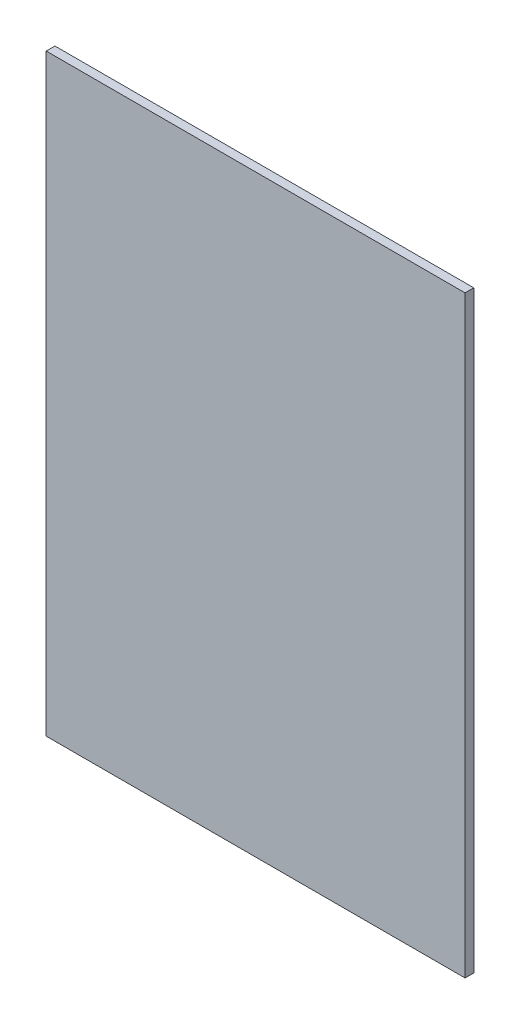
ISO-10303-21;
HEADER;
FILE_DESCRIPTION(('STEP AP214'),'2;1');
FILE_NAME('part.step','',(''),(''),'','','');
FILE_SCHEMA(('AUTOMOTIVE_DESIGN { 1 0 10303 214 1 1 1 1 }'));
ENDSEC;
DATA;
#1=APPLICATION_CONTEXT('core data for automotive mechanical design processes');
#2=APPLICATION_PROTOCOL_DEFINITION('international standard','automotive_design',2000,#1);
#3=PRODUCT_CONTEXT('',#1,'mechanical');
#4=PRODUCT('Part','Part','',(#3));
#5=PRODUCT_RELATED_PRODUCT_CATEGORY('part','',(#4));
#6=PRODUCT_DEFINITION_FORMATION('','',#4);
#7=PRODUCT_DEFINITION_CONTEXT('part definition',#1,'design');
#8=PRODUCT_DEFINITION('design','',#6,#7);
#9=PRODUCT_DEFINITION_SHAPE('','',#8);
#10=(LENGTH_UNIT() NAMED_UNIT(*) SI_UNIT(.MILLI.,.METRE.));
#11=(NAMED_UNIT(*) PLANE_ANGLE_UNIT() SI_UNIT($,.RADIAN.));
#12=(NAMED_UNIT(*) SI_UNIT($,.STERADIAN.) SOLID_ANGLE_UNIT());
#13=UNCERTAINTY_MEASURE_WITH_UNIT(LENGTH_MEASURE(1.E-05),#10,'distance_accuracy_value','');
#14=(GEOMETRIC_REPRESENTATION_CONTEXT(3) GLOBAL_UNCERTAINTY_ASSIGNED_CONTEXT((#13)) GLOBAL_UNIT_ASSIGNED_CONTEXT((#10,
#11,#12)) REPRESENTATION_CONTEXT('',''));
#15=CARTESIAN_POINT('',(0.,0.,0.));
#16=DIRECTION('',(0.,0.,1.));
#17=DIRECTION('',(1.,0.,0.));
#18=AXIS2_PLACEMENT_3D('',#15,#16,#17);
#19=CARTESIAN_POINT('',(-290.,340.,10.));
#20=DIRECTION('',(1.,0.,0.));
#21=DIRECTION('',(0.,1.,0.));
#22=AXIS2_PLACEMENT_3D('',#19,#20,#21);
#23=PLANE('',#22);
#24=DIRECTION('',(0.,-1.,0.));
#25=VECTOR('',#24,1.);
#26=CARTESIAN_POINT('',(-290.,340.,0.));
#27=LINE('',#26,#25);
#28=CARTESIAN_POINT('',(-290.,340.,0.));
#29=VERTEX_POINT('',#28);
#30=CARTESIAN_POINT('',(-290.,-340.,0.));
#31=VERTEX_POINT('',#30);
#32=EDGE_CURVE('E96',#29,#31,#27,.T.);
#33=ORIENTED_EDGE('',*,*,#32,.T.);
#34=DIRECTION('',(0.,0.,-1.));
#35=VECTOR('',#34,1.);
#36=CARTESIAN_POINT('',(-290.,-340.,10.));
#37=LINE('',#36,#35);
#38=CARTESIAN_POINT('',(-290.,-340.,10.));
#39=VERTEX_POINT('',#38);
#40=EDGE_CURVE('E11',#39,#31,#37,.T.);
#41=ORIENTED_EDGE('',*,*,#40,.F.);
#42=DIRECTION('',(0.,-1.,0.));
#43=VECTOR('',#42,1.);
#44=CARTESIAN_POINT('',(-290.,340.,10.));
#45=LINE('',#44,#43);
#46=CARTESIAN_POINT('',(-290.,340.,10.));
#47=VERTEX_POINT('',#46);
#48=EDGE_CURVE('E84',#47,#39,#45,.T.);
#49=ORIENTED_EDGE('',*,*,#48,.F.);
#50=DIRECTION('',(0.,0.,-1.));
#51=VECTOR('',#50,1.);
#52=CARTESIAN_POINT('',(-290.,340.,10.));
#53=LINE('',#52,#51);
#54=EDGE_CURVE('E92',#47,#29,#53,.T.);
#55=ORIENTED_EDGE('',*,*,#54,.T.);
#56=EDGE_LOOP('',(#33,#41,#49,#55));
#57=FACE_BOUND('',#56,.T.);
#58=ADVANCED_FACE('F33',(#57),#23,.F.);
#59=CARTESIAN_POINT('',(-290.,-340.,10.));
#60=DIRECTION('',(0.,1.,0.));
#61=DIRECTION('',(0.,0.,1.));
#62=AXIS2_PLACEMENT_3D('',#59,#60,#61);
#63=PLANE('',#62);
#64=DIRECTION('',(1.,0.,0.));
#65=VECTOR('',#64,1.);
#66=CARTESIAN_POINT('',(-290.,-340.,0.));
#67=LINE('',#66,#65);
#68=CARTESIAN_POINT('',(190.,-340.,0.));
#69=VERTEX_POINT('',#68);
#70=EDGE_CURVE('E88',#31,#69,#67,.T.);
#71=ORIENTED_EDGE('',*,*,#70,.T.);
#72=DIRECTION('',(0.,0.,-1.));
#73=VECTOR('',#72,1.);
#74=CARTESIAN_POINT('',(190.,-340.,10.));
#75=LINE('',#74,#73);
#76=CARTESIAN_POINT('',(190.,-340.,10.));
#77=VERTEX_POINT('',#76);
#78=EDGE_CURVE('E41',#77,#69,#75,.T.);
#79=ORIENTED_EDGE('',*,*,#78,.F.);
#80=DIRECTION('',(1.,0.,0.));
#81=VECTOR('',#80,1.);
#82=CARTESIAN_POINT('',(-290.,-340.,10.));
#83=LINE('',#82,#81);
#84=EDGE_CURVE('E79',#39,#77,#83,.T.);
#85=ORIENTED_EDGE('',*,*,#84,.F.);
#86=ORIENTED_EDGE('',*,*,#40,.T.);
#87=EDGE_LOOP('',(#71,#79,#85,#86));
#88=FACE_BOUND('',#87,.T.);
#89=ADVANCED_FACE('F87',(#88),#63,.F.);
#90=CARTESIAN_POINT('',(190.,340.,10.));
#91=DIRECTION('',(-1.,0.,0.));
#92=DIRECTION('',(0.,-1.,0.));
#93=AXIS2_PLACEMENT_3D('',#90,#91,#92);
#94=PLANE('',#93);
#95=DIRECTION('',(0.,1.,0.));
#96=VECTOR('',#95,1.);
#97=CARTESIAN_POINT('',(190.,340.,0.));
#98=LINE('',#97,#96);
#99=CARTESIAN_POINT('',(190.,340.,0.));
#100=VERTEX_POINT('',#99);
#101=EDGE_CURVE('E66',#69,#100,#98,.T.);
#102=ORIENTED_EDGE('',*,*,#101,.T.);
#103=DIRECTION('',(0.,0.,-1.));
#104=VECTOR('',#103,1.);
#105=CARTESIAN_POINT('',(190.,340.,10.));
#106=LINE('',#105,#104);
#107=CARTESIAN_POINT('',(190.,340.,10.));
#108=VERTEX_POINT('',#107);
#109=EDGE_CURVE('E89',#108,#100,#106,.T.);
#110=ORIENTED_EDGE('',*,*,#109,.F.);
#111=DIRECTION('',(0.,1.,0.));
#112=VECTOR('',#111,1.);
#113=CARTESIAN_POINT('',(190.,340.,10.));
#114=LINE('',#113,#112);
#115=EDGE_CURVE('E82',#77,#108,#114,.T.);
#116=ORIENTED_EDGE('',*,*,#115,.F.);
#117=ORIENTED_EDGE('',*,*,#78,.T.);
#118=EDGE_LOOP('',(#102,#110,#116,#117));
#119=FACE_BOUND('',#118,.T.);
#120=ADVANCED_FACE('F90',(#119),#94,.F.);
#121=CARTESIAN_POINT('',(-290.,340.,10.));
#122=DIRECTION('',(0.,-1.,0.));
#123=DIRECTION('',(0.,0.,-1.));
#124=AXIS2_PLACEMENT_3D('',#121,#122,#123);
#125=PLANE('',#124);
#126=DIRECTION('',(-1.,0.,0.));
#127=VECTOR('',#126,1.);
#128=CARTESIAN_POINT('',(-290.,340.,0.));
#129=LINE('',#128,#127);
#130=EDGE_CURVE('E72',#100,#29,#129,.T.);
#131=ORIENTED_EDGE('',*,*,#130,.T.);
#132=ORIENTED_EDGE('',*,*,#54,.F.);
#133=DIRECTION('',(-1.,0.,0.));
#134=VECTOR('',#133,1.);
#135=CARTESIAN_POINT('',(-290.,340.,10.));
#136=LINE('',#135,#134);
#137=EDGE_CURVE('E49',#108,#47,#136,.T.);
#138=ORIENTED_EDGE('',*,*,#137,.F.);
#139=ORIENTED_EDGE('',*,*,#109,.T.);
#140=EDGE_LOOP('',(#131,#132,#138,#139));
#141=FACE_BOUND('',#140,.T.);
#142=ADVANCED_FACE('F103',(#141),#125,.F.);
#143=CARTESIAN_POINT('',(0.,0.,10.));
#144=DIRECTION('',(0.,0.,1.));
#145=DIRECTION('',(1.,0.,0.));
#146=AXIS2_PLACEMENT_3D('',#143,#144,#145);
#147=PLANE('',#146);
#148=ORIENTED_EDGE('',*,*,#48,.T.);
#149=ORIENTED_EDGE('',*,*,#84,.T.);
#150=ORIENTED_EDGE('',*,*,#115,.T.);
#151=ORIENTED_EDGE('',*,*,#137,.T.);
#152=EDGE_LOOP('',(#148,#149,#150,#151));
#153=FACE_BOUND('',#152,.T.);
#154=ADVANCED_FACE('F80',(#153),#147,.T.);
#155=CARTESIAN_POINT('',(0.,0.,0.));
#156=DIRECTION('',(0.,0.,1.));
#157=DIRECTION('',(1.,0.,0.));
#158=AXIS2_PLACEMENT_3D('',#155,#156,#157);
#159=PLANE('',#158);
#160=ORIENTED_EDGE('',*,*,#32,.F.);
#161=ORIENTED_EDGE('',*,*,#130,.F.);
#162=ORIENTED_EDGE('',*,*,#101,.F.);
#163=ORIENTED_EDGE('',*,*,#70,.F.);
#164=EDGE_LOOP('',(#160,#161,#162,#163));
#165=FACE_BOUND('',#164,.T.);
#166=ADVANCED_FACE('F106',(#165),#159,.F.);
#167=CLOSED_SHELL('',(#58,#89,#120,#142,#154,#166));
#168=MANIFOLD_SOLID_BREP('B2',#167);
#169=ADVANCED_BREP_SHAPE_REPRESENTATION('',(#18,#168),#14);
#170=SHAPE_DEFINITION_REPRESENTATION(#9,#169);
ENDSEC;
END-ISO-10303-21;
